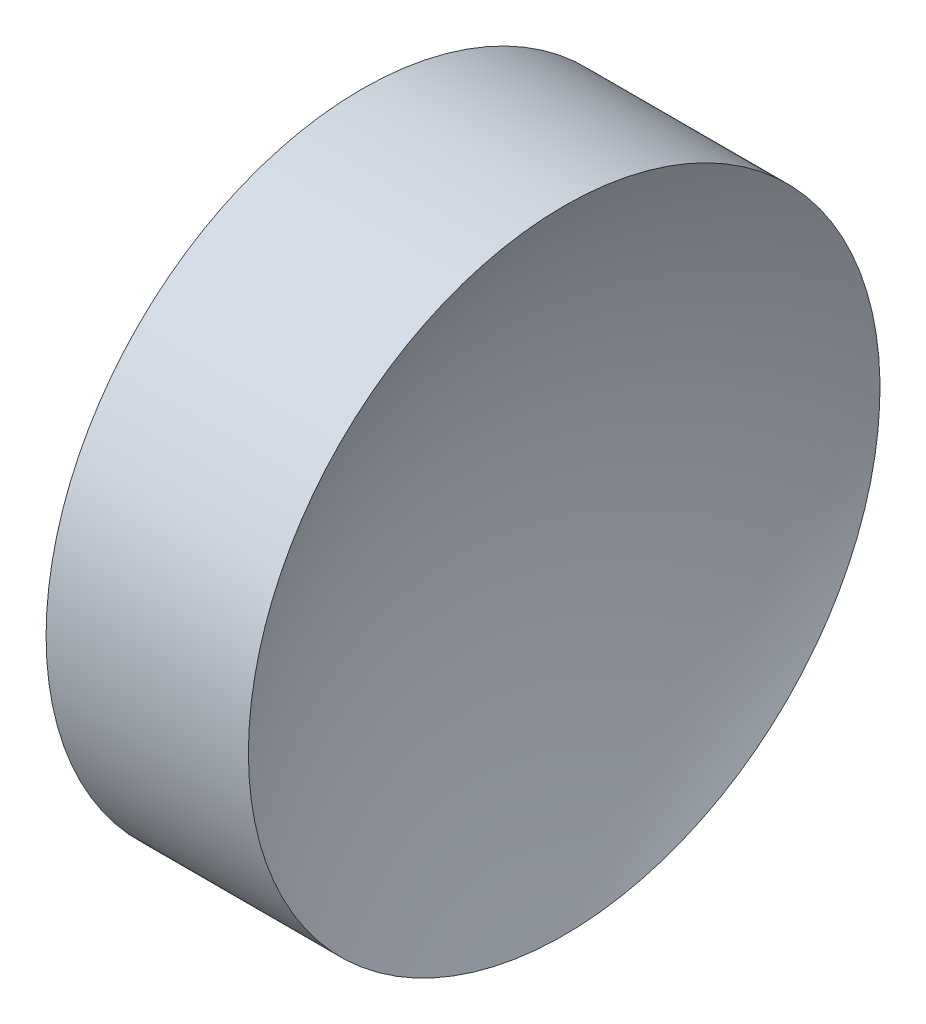
ISO-10303-21;
HEADER;
FILE_DESCRIPTION(('STEP AP214'),'2;1');
FILE_NAME('part.step','',(''),(''),'','','');
FILE_SCHEMA(('AUTOMOTIVE_DESIGN { 1 0 10303 214 1 1 1 1 }'));
ENDSEC;
DATA;
#1=APPLICATION_CONTEXT('core data for automotive mechanical design processes');
#2=APPLICATION_PROTOCOL_DEFINITION('international standard','automotive_design',2000,#1);
#3=PRODUCT_CONTEXT('',#1,'mechanical');
#4=PRODUCT('Part','Part','',(#3));
#5=PRODUCT_RELATED_PRODUCT_CATEGORY('part','',(#4));
#6=PRODUCT_DEFINITION_FORMATION('','',#4);
#7=PRODUCT_DEFINITION_CONTEXT('part definition',#1,'design');
#8=PRODUCT_DEFINITION('design','',#6,#7);
#9=PRODUCT_DEFINITION_SHAPE('','',#8);
#10=(LENGTH_UNIT() NAMED_UNIT(*) SI_UNIT(.MILLI.,.METRE.));
#11=(NAMED_UNIT(*) PLANE_ANGLE_UNIT() SI_UNIT($,.RADIAN.));
#12=(NAMED_UNIT(*) SI_UNIT($,.STERADIAN.) SOLID_ANGLE_UNIT());
#13=UNCERTAINTY_MEASURE_WITH_UNIT(LENGTH_MEASURE(1.E-05),#10,'distance_accuracy_value','');
#14=(GEOMETRIC_REPRESENTATION_CONTEXT(3) GLOBAL_UNCERTAINTY_ASSIGNED_CONTEXT((#13)) GLOBAL_UNIT_ASSIGNED_CONTEXT((#10,
#11,#12)) REPRESENTATION_CONTEXT('',''));
#15=CARTESIAN_POINT('',(0.,0.,0.));
#16=DIRECTION('',(0.,0.,1.));
#17=DIRECTION('',(1.,0.,0.));
#18=AXIS2_PLACEMENT_3D('',#15,#16,#17);
#19=CARTESIAN_POINT('',(148.922703446229,65.2226028729874,0.));
#20=DIRECTION('',(-1.,0.,0.));
#21=DIRECTION('',(0.,1.,0.));
#22=AXIS2_PLACEMENT_3D('',#19,#20,#21);
#23=SPHERICAL_SURFACE('',#22,27.82);
#24=CARTESIAN_POINT('',(124.170685346688,65.2226028729874,0.));
#25=DIRECTION('',(-1.,0.,0.));
#26=DIRECTION('',(0.,0.,1.));
#27=AXIS2_PLACEMENT_3D('',#24,#25,#26);
#28=CIRCLE('',#27,12.7);
#29=CARTESIAN_POINT('',(124.170685346688,65.2226028729874,12.7));
#30=VERTEX_POINT('',#29);
#31=EDGE_CURVE('E10',#30,#30,#28,.T.);
#32=ORIENTED_EDGE('',*,*,#31,.F.);
#33=EDGE_LOOP('',(#32));
#34=FACE_BOUND('',#33,.T.);
#35=ADVANCED_FACE('F35',(#34),#23,.F.);
#36=CARTESIAN_POINT('',(112.241463294787,65.2226028729874,0.));
#37=DIRECTION('',(-1.,0.,0.));
#38=DIRECTION('',(0.,0.,1.));
#39=AXIS2_PLACEMENT_3D('',#36,#37,#38);
#40=CYLINDRICAL_SURFACE('',#39,12.7);
#41=CARTESIAN_POINT('',(116.03472154577,65.2226028729874,0.));
#42=DIRECTION('',(-1.,0.,0.));
#43=DIRECTION('',(0.,0.,1.));
#44=AXIS2_PLACEMENT_3D('',#41,#42,#43);
#45=CIRCLE('',#44,12.7);
#46=CARTESIAN_POINT('',(116.03472154577,65.2226028729874,12.7));
#47=VERTEX_POINT('',#46);
#48=EDGE_CURVE('E41',#47,#47,#45,.T.);
#49=ORIENTED_EDGE('',*,*,#48,.F.);
#50=EDGE_LOOP('',(#49));
#51=FACE_BOUND('',#50,.T.);
#52=ORIENTED_EDGE('',*,*,#31,.T.);
#53=EDGE_LOOP('',(#52));
#54=FACE_BOUND('',#53,.T.);
#55=ADVANCED_FACE('F49',(#51,#54),#40,.T.);
#56=CARTESIAN_POINT('',(91.2827034462293,65.2226028729874,0.));
#57=DIRECTION('',(-1.,0.,0.));
#58=DIRECTION('',(0.,1.,0.));
#59=AXIS2_PLACEMENT_3D('',#56,#57,#58);
#60=SPHERICAL_SURFACE('',#59,27.82);
#61=ORIENTED_EDGE('',*,*,#48,.T.);
#62=EDGE_LOOP('',(#61));
#63=FACE_BOUND('',#62,.T.);
#64=ADVANCED_FACE('F47',(#63),#60,.F.);
#65=CLOSED_SHELL('',(#35,#55,#64));
#66=MANIFOLD_SOLID_BREP('B2',#65);
#67=ADVANCED_BREP_SHAPE_REPRESENTATION('',(#18,#66),#14);
#68=SHAPE_DEFINITION_REPRESENTATION(#9,#67);
ENDSEC;
END-ISO-10303-21;
